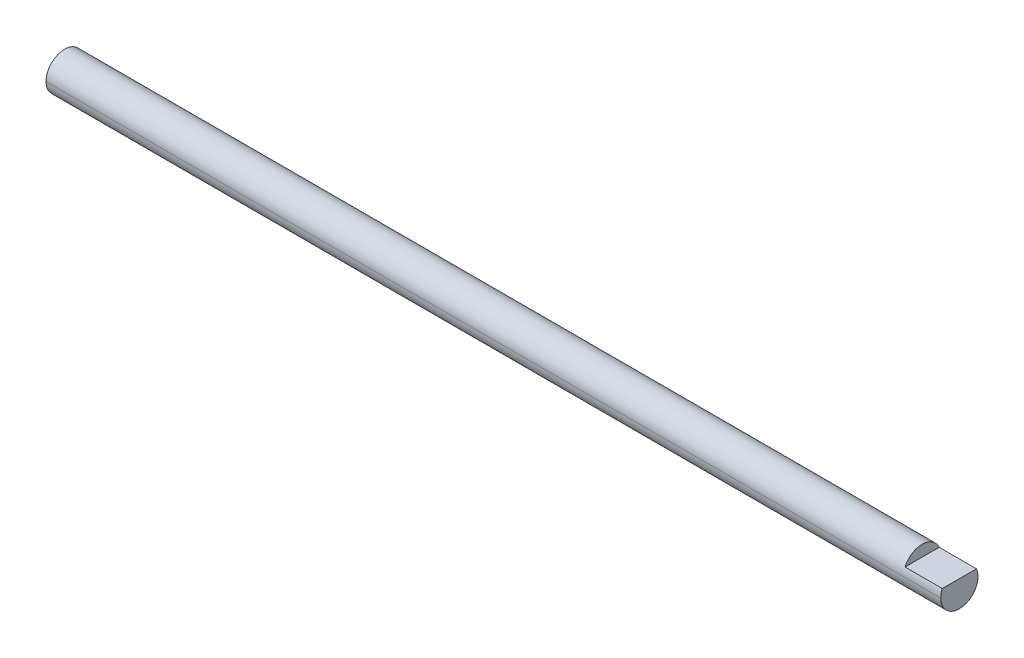
ISO-10303-21;
HEADER;
FILE_DESCRIPTION(('STEP AP214'),'2;1');
FILE_NAME('part.step','',(''),(''),'','','');
FILE_SCHEMA(('AUTOMOTIVE_DESIGN { 1 0 10303 214 1 1 1 1 }'));
ENDSEC;
DATA;
#1=APPLICATION_CONTEXT('core data for automotive mechanical design processes');
#2=APPLICATION_PROTOCOL_DEFINITION('international standard','automotive_design',2000,#1);
#3=PRODUCT_CONTEXT('',#1,'mechanical');
#4=PRODUCT('Part','Part','',(#3));
#5=PRODUCT_RELATED_PRODUCT_CATEGORY('part','',(#4));
#6=PRODUCT_DEFINITION_FORMATION('','',#4);
#7=PRODUCT_DEFINITION_CONTEXT('part definition',#1,'design');
#8=PRODUCT_DEFINITION('design','',#6,#7);
#9=PRODUCT_DEFINITION_SHAPE('','',#8);
#10=(LENGTH_UNIT() NAMED_UNIT(*) SI_UNIT(.MILLI.,.METRE.));
#11=(NAMED_UNIT(*) PLANE_ANGLE_UNIT() SI_UNIT($,.RADIAN.));
#12=(NAMED_UNIT(*) SI_UNIT($,.STERADIAN.) SOLID_ANGLE_UNIT());
#13=UNCERTAINTY_MEASURE_WITH_UNIT(LENGTH_MEASURE(1.E-05),#10,'distance_accuracy_value','');
#14=(GEOMETRIC_REPRESENTATION_CONTEXT(3) GLOBAL_UNCERTAINTY_ASSIGNED_CONTEXT((#13)) GLOBAL_UNIT_ASSIGNED_CONTEXT((#10,
#11,#12)) REPRESENTATION_CONTEXT('',''));
#15=CARTESIAN_POINT('',(0.,0.,0.));
#16=DIRECTION('',(0.,0.,1.));
#17=DIRECTION('',(1.,0.,0.));
#18=AXIS2_PLACEMENT_3D('',#15,#16,#17);
#19=CARTESIAN_POINT('',(600.,0.,0.));
#20=DIRECTION('',(1.,0.,0.));
#21=DIRECTION('',(0.,-1.,0.));
#22=AXIS2_PLACEMENT_3D('',#19,#20,#21);
#23=CYLINDRICAL_SURFACE('',#22,5.);
#24=CARTESIAN_POINT('',(240.,0.,0.));
#25=DIRECTION('',(1.,0.,0.));
#26=DIRECTION('',(0.,0.,-1.));
#27=AXIS2_PLACEMENT_3D('',#24,#25,#26);
#28=CIRCLE('',#27,5.);
#29=CARTESIAN_POINT('',(240.,2.00000000000311,4.58257569495448));
#30=VERTEX_POINT('',#29);
#31=CARTESIAN_POINT('',(240.,0.,5.));
#32=VERTEX_POINT('',#31);
#33=EDGE_CURVE('E63',#30,#32,#28,.T.);
#34=ORIENTED_EDGE('',*,*,#33,.F.);
#35=DIRECTION('',(1.,0.,0.));
#36=VECTOR('',#35,1.);
#37=CARTESIAN_POINT('',(230.,2.,4.58257569494736));
#38=LINE('',#37,#36);
#39=CARTESIAN_POINT('',(230.,2.,4.58257569494736));
#40=VERTEX_POINT('',#39);
#41=EDGE_CURVE('E56',#40,#30,#38,.T.);
#42=ORIENTED_EDGE('',*,*,#41,.F.);
#43=CARTESIAN_POINT('',(230.,0.,-8.54871728961371E-12));
#44=DIRECTION('',(1.,0.,0.));
#45=DIRECTION('',(0.,0.,-1.));
#46=AXIS2_PLACEMENT_3D('',#43,#44,#45);
#47=CIRCLE('',#46,5.);
#48=CARTESIAN_POINT('',(230.,2.,-4.58257569496434));
#49=VERTEX_POINT('',#48);
#50=EDGE_CURVE('E90',#49,#40,#47,.T.);
#51=ORIENTED_EDGE('',*,*,#50,.F.);
#52=DIRECTION('',(1.,0.,0.));
#53=VECTOR('',#52,1.);
#54=CARTESIAN_POINT('',(230.,2.,-4.58257569496434));
#55=LINE('',#54,#53);
#56=CARTESIAN_POINT('',(240.,2.,-4.58257569496434));
#57=VERTEX_POINT('',#56);
#58=EDGE_CURVE('E80',#49,#57,#55,.T.);
#59=ORIENTED_EDGE('',*,*,#58,.T.);
#60=CARTESIAN_POINT('',(240.,0.,-5.));
#61=VERTEX_POINT('',#60);
#62=EDGE_CURVE('E100',#61,#57,#28,.T.);
#63=ORIENTED_EDGE('',*,*,#62,.F.);
#64=DIRECTION('',(1.,0.,0.));
#65=VECTOR('',#64,1.);
#66=CARTESIAN_POINT('',(0.,0.,-5.));
#67=LINE('',#66,#65);
#68=CARTESIAN_POINT('',(0.,0.,-5.));
#69=VERTEX_POINT('',#68);
#70=EDGE_CURVE('E102',#69,#61,#67,.T.);
#71=ORIENTED_EDGE('',*,*,#70,.F.);
#72=CARTESIAN_POINT('',(0.,0.,0.));
#73=DIRECTION('',(1.,0.,0.));
#74=DIRECTION('',(0.,0.,-1.));
#75=AXIS2_PLACEMENT_3D('',#72,#73,#74);
#76=CIRCLE('',#75,5.);
#77=CARTESIAN_POINT('',(0.,0.,5.));
#78=VERTEX_POINT('',#77);
#79=EDGE_CURVE('E49',#69,#78,#76,.T.);
#80=ORIENTED_EDGE('',*,*,#79,.T.);
#81=DIRECTION('',(1.,0.,0.));
#82=VECTOR('',#81,1.);
#83=CARTESIAN_POINT('',(0.,0.,5.));
#84=LINE('',#83,#82);
#85=EDGE_CURVE('E105',#78,#32,#84,.T.);
#86=ORIENTED_EDGE('',*,*,#85,.T.);
#87=EDGE_LOOP('',(#34,#42,#51,#59,#63,#71,#80,#86));
#88=FACE_BOUND('',#87,.T.);
#89=ADVANCED_FACE('F40',(#88),#23,.T.);
#90=CARTESIAN_POINT('',(240.,0.,0.));
#91=DIRECTION('',(1.,0.,0.));
#92=DIRECTION('',(0.,0.,-1.));
#93=AXIS2_PLACEMENT_3D('',#90,#91,#92);
#94=PLANE('',#93);
#95=ORIENTED_EDGE('',*,*,#62,.T.);
#96=DIRECTION('',(0.,0.,1.));
#97=VECTOR('',#96,1.);
#98=CARTESIAN_POINT('',(240.,2.,-8.54871728961371E-12));
#99=LINE('',#98,#97);
#100=EDGE_CURVE('E85',#57,#30,#99,.T.);
#101=ORIENTED_EDGE('',*,*,#100,.T.);
#102=ORIENTED_EDGE('',*,*,#33,.T.);
#103=EDGE_CURVE('E98',#32,#61,#28,.T.);
#104=ORIENTED_EDGE('',*,*,#103,.T.);
#105=EDGE_LOOP('',(#95,#101,#102,#104));
#106=FACE_BOUND('',#105,.T.);
#107=ADVANCED_FACE('F120',(#106),#94,.T.);
#108=CARTESIAN_POINT('',(600.,0.,0.));
#109=DIRECTION('',(1.,0.,0.));
#110=DIRECTION('',(0.,1.,0.));
#111=AXIS2_PLACEMENT_3D('',#108,#109,#110);
#112=CYLINDRICAL_SURFACE('',#111,5.);
#113=ORIENTED_EDGE('',*,*,#70,.T.);
#114=ORIENTED_EDGE('',*,*,#103,.F.);
#115=ORIENTED_EDGE('',*,*,#85,.F.);
#116=CARTESIAN_POINT('',(0.,0.,0.));
#117=DIRECTION('',(1.,0.,0.));
#118=DIRECTION('',(0.,0.,-1.));
#119=AXIS2_PLACEMENT_3D('',#116,#117,#118);
#120=CIRCLE('',#119,5.);
#121=EDGE_CURVE('E11',#78,#69,#120,.T.);
#122=ORIENTED_EDGE('',*,*,#121,.T.);
#123=EDGE_LOOP('',(#113,#114,#115,#122));
#124=FACE_BOUND('',#123,.T.);
#125=ADVANCED_FACE('F119',(#124),#112,.T.);
#126=CARTESIAN_POINT('',(0.,0.,0.));
#127=DIRECTION('',(1.,0.,0.));
#128=DIRECTION('',(0.,0.,-1.));
#129=AXIS2_PLACEMENT_3D('',#126,#127,#128);
#130=PLANE('',#129);
#131=ORIENTED_EDGE('',*,*,#121,.F.);
#132=ORIENTED_EDGE('',*,*,#79,.F.);
#133=EDGE_LOOP('',(#131,#132));
#134=FACE_BOUND('',#133,.T.);
#135=ADVANCED_FACE('F42',(#134),#130,.F.);
#136=CARTESIAN_POINT('',(230.,2.,-8.54871728961371E-12));
#137=DIRECTION('',(0.,1.,0.));
#138=DIRECTION('',(0.,0.,1.));
#139=AXIS2_PLACEMENT_3D('',#136,#137,#138);
#140=PLANE('',#139);
#141=ORIENTED_EDGE('',*,*,#100,.F.);
#142=ORIENTED_EDGE('',*,*,#58,.F.);
#143=DIRECTION('',(0.,0.,1.));
#144=VECTOR('',#143,1.);
#145=CARTESIAN_POINT('',(230.,2.,-8.54871728961371E-12));
#146=LINE('',#145,#144);
#147=EDGE_CURVE('E83',#49,#40,#146,.T.);
#148=ORIENTED_EDGE('',*,*,#147,.T.);
#149=ORIENTED_EDGE('',*,*,#41,.T.);
#150=EDGE_LOOP('',(#141,#142,#148,#149));
#151=FACE_BOUND('',#150,.T.);
#152=ADVANCED_FACE('F82',(#151),#140,.T.);
#153=CARTESIAN_POINT('',(230.,0.,-8.54871728961371E-12));
#154=DIRECTION('',(1.,0.,0.));
#155=DIRECTION('',(0.,0.,-1.));
#156=AXIS2_PLACEMENT_3D('',#153,#154,#155);
#157=PLANE('',#156);
#158=ORIENTED_EDGE('',*,*,#147,.F.);
#159=ORIENTED_EDGE('',*,*,#50,.T.);
#160=EDGE_LOOP('',(#158,#159));
#161=FACE_BOUND('',#160,.T.);
#162=ADVANCED_FACE('F93',(#161),#157,.T.);
#163=CLOSED_SHELL('',(#89,#107,#125,#135,#152,#162));
#164=MANIFOLD_SOLID_BREP('B2',#163);
#165=ADVANCED_BREP_SHAPE_REPRESENTATION('',(#18,#164),#14);
#166=SHAPE_DEFINITION_REPRESENTATION(#9,#165);
ENDSEC;
END-ISO-10303-21;
